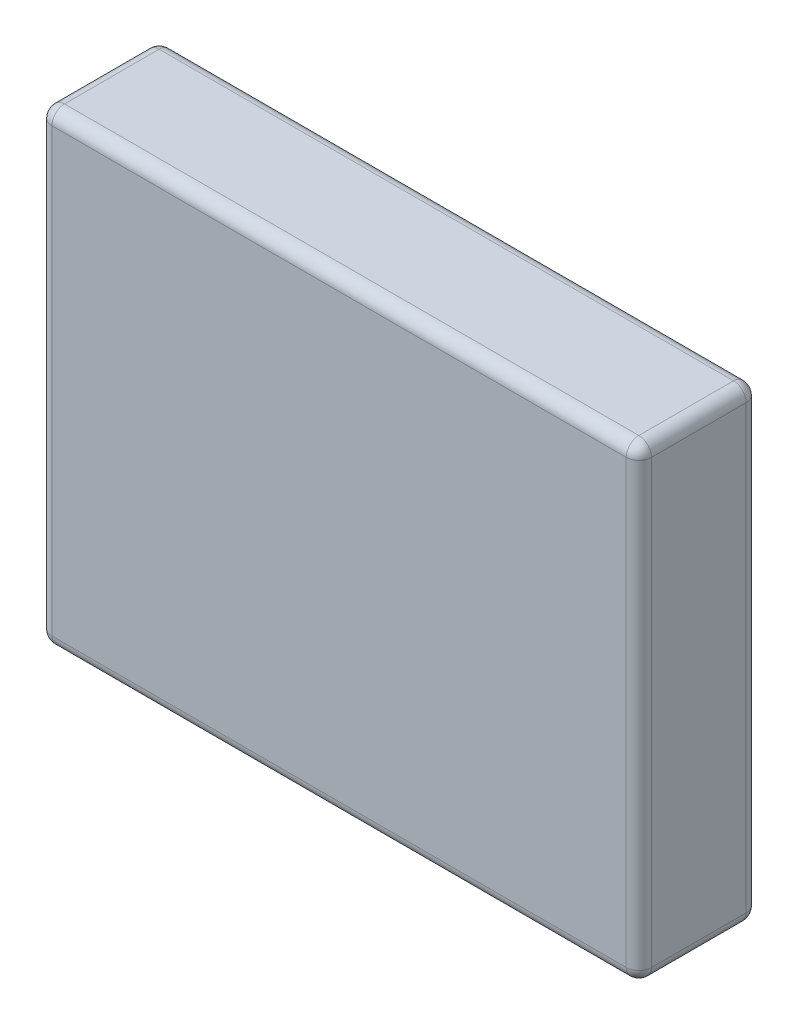
ISO-10303-21;
HEADER;
FILE_DESCRIPTION(('STEP AP214'),'2;1');
FILE_NAME('part.step','',(''),(''),'','','');
FILE_SCHEMA(('AUTOMOTIVE_DESIGN { 1 0 10303 214 1 1 1 1 }'));
ENDSEC;
DATA;
#1=APPLICATION_CONTEXT('core data for automotive mechanical design processes');
#2=APPLICATION_PROTOCOL_DEFINITION('international standard','automotive_design',2000,#1);
#3=PRODUCT_CONTEXT('',#1,'mechanical');
#4=PRODUCT('Part','Part','',(#3));
#5=PRODUCT_RELATED_PRODUCT_CATEGORY('part','',(#4));
#6=PRODUCT_DEFINITION_FORMATION('','',#4);
#7=PRODUCT_DEFINITION_CONTEXT('part definition',#1,'design');
#8=PRODUCT_DEFINITION('design','',#6,#7);
#9=PRODUCT_DEFINITION_SHAPE('','',#8);
#10=(LENGTH_UNIT() NAMED_UNIT(*) SI_UNIT(.MILLI.,.METRE.));
#11=(NAMED_UNIT(*) PLANE_ANGLE_UNIT() SI_UNIT($,.RADIAN.));
#12=(NAMED_UNIT(*) SI_UNIT($,.STERADIAN.) SOLID_ANGLE_UNIT());
#13=UNCERTAINTY_MEASURE_WITH_UNIT(LENGTH_MEASURE(1.E-05),#10,'distance_accuracy_value','');
#14=(GEOMETRIC_REPRESENTATION_CONTEXT(3) GLOBAL_UNCERTAINTY_ASSIGNED_CONTEXT((#13)) GLOBAL_UNIT_ASSIGNED_CONTEXT((#10,
#11,#12)) REPRESENTATION_CONTEXT('',''));
#15=CARTESIAN_POINT('',(0.,0.,0.));
#16=DIRECTION('',(0.,0.,1.));
#17=DIRECTION('',(1.,0.,0.));
#18=AXIS2_PLACEMENT_3D('',#15,#16,#17);
#19=CARTESIAN_POINT('',(-47.5,37.,19.));
#20=DIRECTION('',(1.,0.,0.));
#21=DIRECTION('',(0.,1.,0.));
#22=AXIS2_PLACEMENT_3D('',#19,#20,#21);
#23=PLANE('',#22);
#24=DIRECTION('',(0.,-1.,0.));
#25=VECTOR('',#24,1.);
#26=CARTESIAN_POINT('',(-47.5,37.,17.));
#27=LINE('',#26,#25);
#28=CARTESIAN_POINT('',(-47.5,-35.,17.));
#29=VERTEX_POINT('',#28);
#30=CARTESIAN_POINT('',(-47.5,35.,17.));
#31=VERTEX_POINT('',#30);
#32=EDGE_CURVE('E164',#29,#31,#27,.F.);
#33=ORIENTED_EDGE('',*,*,#32,.T.);
#34=DIRECTION('',(0.,0.,-1.));
#35=VECTOR('',#34,1.);
#36=CARTESIAN_POINT('',(-47.5,35.,19.));
#37=LINE('',#36,#35);
#38=CARTESIAN_POINT('',(-47.5,35.,2.));
#39=VERTEX_POINT('',#38);
#40=EDGE_CURVE('E167',#31,#39,#37,.T.);
#41=ORIENTED_EDGE('',*,*,#40,.T.);
#42=DIRECTION('',(0.,-1.,0.));
#43=VECTOR('',#42,1.);
#44=CARTESIAN_POINT('',(-47.5,37.,2.));
#45=LINE('',#44,#43);
#46=CARTESIAN_POINT('',(-47.5,-35.,2.));
#47=VERTEX_POINT('',#46);
#48=EDGE_CURVE('E138',#39,#47,#45,.T.);
#49=ORIENTED_EDGE('',*,*,#48,.T.);
#50=DIRECTION('',(0.,0.,-1.));
#51=VECTOR('',#50,1.);
#52=CARTESIAN_POINT('',(-47.5,-35.,19.));
#53=LINE('',#52,#51);
#54=EDGE_CURVE('E158',#47,#29,#53,.F.);
#55=ORIENTED_EDGE('',*,*,#54,.T.);
#56=EDGE_LOOP('',(#33,#41,#49,#55));
#57=FACE_BOUND('',#56,.T.);
#58=ADVANCED_FACE('F39',(#57),#23,.F.);
#59=CARTESIAN_POINT('',(-47.5,-37.,19.));
#60=DIRECTION('',(0.,1.,0.));
#61=DIRECTION('',(-1.,0.,0.));
#62=AXIS2_PLACEMENT_3D('',#59,#60,#61);
#63=PLANE('',#62);
#64=DIRECTION('',(1.,0.,0.));
#65=VECTOR('',#64,1.);
#66=CARTESIAN_POINT('',(-47.5,-37.,2.));
#67=LINE('',#66,#65);
#68=CARTESIAN_POINT('',(-45.5,-37.,2.));
#69=VERTEX_POINT('',#68);
#70=CARTESIAN_POINT('',(45.5,-37.,2.));
#71=VERTEX_POINT('',#70);
#72=EDGE_CURVE('E193',#69,#71,#67,.T.);
#73=ORIENTED_EDGE('',*,*,#72,.T.);
#74=DIRECTION('',(0.,0.,-1.));
#75=VECTOR('',#74,1.);
#76=CARTESIAN_POINT('',(45.5,-37.,19.));
#77=LINE('',#76,#75);
#78=CARTESIAN_POINT('',(45.5,-37.,17.));
#79=VERTEX_POINT('',#78);
#80=EDGE_CURVE('E197',#71,#79,#77,.F.);
#81=ORIENTED_EDGE('',*,*,#80,.T.);
#82=DIRECTION('',(1.,0.,0.));
#83=VECTOR('',#82,1.);
#84=CARTESIAN_POINT('',(-47.5,-37.,17.));
#85=LINE('',#84,#83);
#86=CARTESIAN_POINT('',(-45.5,-37.,17.));
#87=VERTEX_POINT('',#86);
#88=EDGE_CURVE('E190',#79,#87,#85,.F.);
#89=ORIENTED_EDGE('',*,*,#88,.T.);
#90=DIRECTION('',(0.,0.,-1.));
#91=VECTOR('',#90,1.);
#92=CARTESIAN_POINT('',(-45.5,-37.,19.));
#93=LINE('',#92,#91);
#94=EDGE_CURVE('E187',#87,#69,#93,.T.);
#95=ORIENTED_EDGE('',*,*,#94,.T.);
#96=EDGE_LOOP('',(#73,#81,#89,#95));
#97=FACE_BOUND('',#96,.T.);
#98=ADVANCED_FACE('F377',(#97),#63,.F.);
#99=CARTESIAN_POINT('',(47.5,37.,19.));
#100=DIRECTION('',(-1.,0.,0.));
#101=DIRECTION('',(0.,-1.,0.));
#102=AXIS2_PLACEMENT_3D('',#99,#100,#101);
#103=PLANE('',#102);
#104=DIRECTION('',(0.,0.,-1.));
#105=VECTOR('',#104,1.);
#106=CARTESIAN_POINT('',(47.5,-35.,19.));
#107=LINE('',#106,#105);
#108=CARTESIAN_POINT('',(47.5,-35.,17.));
#109=VERTEX_POINT('',#108);
#110=CARTESIAN_POINT('',(47.5,-35.,2.));
#111=VERTEX_POINT('',#110);
#112=EDGE_CURVE('E203',#109,#111,#107,.T.);
#113=ORIENTED_EDGE('',*,*,#112,.T.);
#114=DIRECTION('',(0.,1.,0.));
#115=VECTOR('',#114,1.);
#116=CARTESIAN_POINT('',(47.5,37.,2.));
#117=LINE('',#116,#115);
#118=CARTESIAN_POINT('',(47.5,35.,2.));
#119=VERTEX_POINT('',#118);
#120=EDGE_CURVE('E209',#111,#119,#117,.T.);
#121=ORIENTED_EDGE('',*,*,#120,.T.);
#122=DIRECTION('',(0.,0.,-1.));
#123=VECTOR('',#122,1.);
#124=CARTESIAN_POINT('',(47.5,35.,19.));
#125=LINE('',#124,#123);
#126=CARTESIAN_POINT('',(47.5,35.,17.));
#127=VERTEX_POINT('',#126);
#128=EDGE_CURVE('E206',#119,#127,#125,.F.);
#129=ORIENTED_EDGE('',*,*,#128,.T.);
#130=DIRECTION('',(0.,1.,0.));
#131=VECTOR('',#130,1.);
#132=CARTESIAN_POINT('',(47.5,-37.,17.));
#133=LINE('',#132,#131);
#134=EDGE_CURVE('E200',#127,#109,#133,.F.);
#135=ORIENTED_EDGE('',*,*,#134,.T.);
#136=EDGE_LOOP('',(#113,#121,#129,#135));
#137=FACE_BOUND('',#136,.T.);
#138=ADVANCED_FACE('F348',(#137),#103,.F.);
#139=CARTESIAN_POINT('',(-47.5,37.,19.));
#140=DIRECTION('',(0.,-1.,0.));
#141=DIRECTION('',(0.,0.,-1.));
#142=AXIS2_PLACEMENT_3D('',#139,#140,#141);
#143=PLANE('',#142);
#144=DIRECTION('',(-1.,0.,0.));
#145=VECTOR('',#144,1.);
#146=CARTESIAN_POINT('',(-47.5,37.,2.));
#147=LINE('',#146,#145);
#148=CARTESIAN_POINT('',(45.5,37.,2.));
#149=VERTEX_POINT('',#148);
#150=CARTESIAN_POINT('',(-45.5,37.,2.));
#151=VERTEX_POINT('',#150);
#152=EDGE_CURVE('E219',#149,#151,#147,.T.);
#153=ORIENTED_EDGE('',*,*,#152,.T.);
#154=DIRECTION('',(0.,0.,-1.));
#155=VECTOR('',#154,1.);
#156=CARTESIAN_POINT('',(-45.5,37.,19.));
#157=LINE('',#156,#155);
#158=CARTESIAN_POINT('',(-45.5,37.,17.));
#159=VERTEX_POINT('',#158);
#160=EDGE_CURVE('E223',#151,#159,#157,.F.);
#161=ORIENTED_EDGE('',*,*,#160,.T.);
#162=DIRECTION('',(-1.,0.,0.));
#163=VECTOR('',#162,1.);
#164=CARTESIAN_POINT('',(47.5,37.,17.));
#165=LINE('',#164,#163);
#166=CARTESIAN_POINT('',(45.5,37.,17.));
#167=VERTEX_POINT('',#166);
#168=EDGE_CURVE('E216',#159,#167,#165,.F.);
#169=ORIENTED_EDGE('',*,*,#168,.T.);
#170=DIRECTION('',(0.,0.,-1.));
#171=VECTOR('',#170,1.);
#172=CARTESIAN_POINT('',(45.5,37.,19.));
#173=LINE('',#172,#171);
#174=EDGE_CURVE('E213',#167,#149,#173,.T.);
#175=ORIENTED_EDGE('',*,*,#174,.T.);
#176=EDGE_LOOP('',(#153,#161,#169,#175));
#177=FACE_BOUND('',#176,.T.);
#178=ADVANCED_FACE('F323',(#177),#143,.F.);
#179=CARTESIAN_POINT('',(0.,0.,19.));
#180=DIRECTION('',(0.,0.,1.));
#181=DIRECTION('',(1.,0.,0.));
#182=AXIS2_PLACEMENT_3D('',#179,#180,#181);
#183=PLANE('',#182);
#184=DIRECTION('',(-1.,0.,0.));
#185=VECTOR('',#184,1.);
#186=CARTESIAN_POINT('',(-47.5,35.,19.));
#187=LINE('',#186,#185);
#188=CARTESIAN_POINT('',(45.5,35.,19.));
#189=VERTEX_POINT('',#188);
#190=CARTESIAN_POINT('',(-45.5,35.,19.));
#191=VERTEX_POINT('',#190);
#192=EDGE_CURVE('E64',#189,#191,#187,.T.);
#193=ORIENTED_EDGE('',*,*,#192,.T.);
#194=DIRECTION('',(0.,-1.,0.));
#195=VECTOR('',#194,1.);
#196=CARTESIAN_POINT('',(-45.5,-37.,19.));
#197=LINE('',#196,#195);
#198=CARTESIAN_POINT('',(-45.5,-35.,19.));
#199=VERTEX_POINT('',#198);
#200=EDGE_CURVE('E11',#191,#199,#197,.T.);
#201=ORIENTED_EDGE('',*,*,#200,.T.);
#202=DIRECTION('',(1.,0.,0.));
#203=VECTOR('',#202,1.);
#204=CARTESIAN_POINT('',(47.5,-35.,19.));
#205=LINE('',#204,#203);
#206=CARTESIAN_POINT('',(45.5,-35.,19.));
#207=VERTEX_POINT('',#206);
#208=EDGE_CURVE('E49',#199,#207,#205,.T.);
#209=ORIENTED_EDGE('',*,*,#208,.T.);
#210=DIRECTION('',(0.,1.,0.));
#211=VECTOR('',#210,1.);
#212=CARTESIAN_POINT('',(45.5,37.,19.));
#213=LINE('',#212,#211);
#214=EDGE_CURVE('E226',#207,#189,#213,.T.);
#215=ORIENTED_EDGE('',*,*,#214,.T.);
#216=EDGE_LOOP('',(#193,#201,#209,#215));
#217=FACE_BOUND('',#216,.T.);
#218=ADVANCED_FACE('F337',(#217),#183,.T.);
#219=CARTESIAN_POINT('',(0.,0.,0.));
#220=DIRECTION('',(0.,0.,1.));
#221=DIRECTION('',(1.,0.,0.));
#222=AXIS2_PLACEMENT_3D('',#219,#220,#221);
#223=PLANE('',#222);
#224=DIRECTION('',(1.,0.,0.));
#225=VECTOR('',#224,1.);
#226=CARTESIAN_POINT('',(0.,-35.,0.));
#227=LINE('',#226,#225);
#228=CARTESIAN_POINT('',(45.5,-35.,0.));
#229=VERTEX_POINT('',#228);
#230=CARTESIAN_POINT('',(-45.5,-35.,0.));
#231=VERTEX_POINT('',#230);
#232=EDGE_CURVE('E182',#229,#231,#227,.F.);
#233=ORIENTED_EDGE('',*,*,#232,.T.);
#234=DIRECTION('',(0.,-1.,0.));
#235=VECTOR('',#234,1.);
#236=CARTESIAN_POINT('',(-45.5,0.,0.));
#237=LINE('',#236,#235);
#238=CARTESIAN_POINT('',(-45.5,35.,0.));
#239=VERTEX_POINT('',#238);
#240=EDGE_CURVE('E140',#231,#239,#237,.F.);
#241=ORIENTED_EDGE('',*,*,#240,.T.);
#242=DIRECTION('',(-1.,0.,0.));
#243=VECTOR('',#242,1.);
#244=CARTESIAN_POINT('',(0.,35.,0.));
#245=LINE('',#244,#243);
#246=CARTESIAN_POINT('',(45.5,35.,0.));
#247=VERTEX_POINT('',#246);
#248=EDGE_CURVE('E173',#239,#247,#245,.F.);
#249=ORIENTED_EDGE('',*,*,#248,.T.);
#250=DIRECTION('',(0.,1.,0.));
#251=VECTOR('',#250,1.);
#252=CARTESIAN_POINT('',(45.5,0.,0.));
#253=LINE('',#252,#251);
#254=EDGE_CURVE('E179',#247,#229,#253,.F.);
#255=ORIENTED_EDGE('',*,*,#254,.T.);
#256=EDGE_LOOP('',(#233,#241,#249,#255));
#257=FACE_BOUND('',#256,.T.);
#258=ADVANCED_FACE('F535',(#257),#223,.F.);
#259=CARTESIAN_POINT('',(45.5,0.,17.));
#260=DIRECTION('',(0.,-1.,0.));
#261=DIRECTION('',(1.,0.,0.));
#262=AXIS2_PLACEMENT_3D('',#259,#260,#261);
#263=CYLINDRICAL_SURFACE('',#262,2.);
#264=CARTESIAN_POINT('',(45.5,35.,17.));
#265=DIRECTION('',(0.,1.,0.));
#266=DIRECTION('',(0.,0.,1.));
#267=AXIS2_PLACEMENT_3D('',#264,#265,#266);
#268=CIRCLE('',#267,2.);
#269=EDGE_CURVE('E43',#189,#127,#268,.T.);
#270=ORIENTED_EDGE('',*,*,#269,.F.);
#271=ORIENTED_EDGE('',*,*,#214,.F.);
#272=CARTESIAN_POINT('',(45.5,-35.,17.));
#273=DIRECTION('',(0.,-1.,0.));
#274=DIRECTION('',(0.,0.,-1.));
#275=AXIS2_PLACEMENT_3D('',#272,#273,#274);
#276=CIRCLE('',#275,2.);
#277=EDGE_CURVE('E299',#109,#207,#276,.T.);
#278=ORIENTED_EDGE('',*,*,#277,.F.);
#279=ORIENTED_EDGE('',*,*,#134,.F.);
#280=EDGE_LOOP('',(#270,#271,#278,#279));
#281=FACE_BOUND('',#280,.T.);
#282=ADVANCED_FACE('F41',(#281),#263,.T.);
#283=CARTESIAN_POINT('',(45.5,35.,17.));
#284=DIRECTION('',(0.,0.,1.));
#285=DIRECTION('',(1.,0.,0.));
#286=AXIS2_PLACEMENT_3D('',#283,#284,#285);
#287=SPHERICAL_SURFACE('',#286,2.);
#288=CARTESIAN_POINT('',(45.5,35.,17.));
#289=DIRECTION('',(1.,0.,0.));
#290=DIRECTION('',(0.,0.,-1.));
#291=AXIS2_PLACEMENT_3D('',#288,#289,#290);
#292=CIRCLE('',#291,2.);
#293=EDGE_CURVE('E292',#189,#167,#292,.F.);
#294=ORIENTED_EDGE('',*,*,#293,.F.);
#295=ORIENTED_EDGE('',*,*,#269,.T.);
#296=CARTESIAN_POINT('',(45.5,35.,17.));
#297=DIRECTION('',(0.,0.,1.));
#298=DIRECTION('',(1.,0.,0.));
#299=AXIS2_PLACEMENT_3D('',#296,#297,#298);
#300=CIRCLE('',#299,2.);
#301=EDGE_CURVE('E296',#167,#127,#300,.F.);
#302=ORIENTED_EDGE('',*,*,#301,.F.);
#303=EDGE_LOOP('',(#294,#295,#302));
#304=FACE_BOUND('',#303,.T.);
#305=ADVANCED_FACE('F312',(#304),#287,.T.);
#306=CARTESIAN_POINT('',(45.5,-35.,17.));
#307=DIRECTION('',(0.,0.,1.));
#308=DIRECTION('',(1.,0.,0.));
#309=AXIS2_PLACEMENT_3D('',#306,#307,#308);
#310=SPHERICAL_SURFACE('',#309,2.);
#311=CARTESIAN_POINT('',(45.5,-35.,17.));
#312=DIRECTION('',(0.,0.,1.));
#313=DIRECTION('',(1.,0.,0.));
#314=AXIS2_PLACEMENT_3D('',#311,#312,#313);
#315=CIRCLE('',#314,2.);
#316=EDGE_CURVE('E284',#109,#79,#315,.F.);
#317=ORIENTED_EDGE('',*,*,#316,.F.);
#318=ORIENTED_EDGE('',*,*,#277,.T.);
#319=CARTESIAN_POINT('',(45.5,-35.,17.));
#320=DIRECTION('',(1.,0.,0.));
#321=DIRECTION('',(0.,0.,-1.));
#322=AXIS2_PLACEMENT_3D('',#319,#320,#321);
#323=CIRCLE('',#322,2.);
#324=EDGE_CURVE('E288',#79,#207,#323,.F.);
#325=ORIENTED_EDGE('',*,*,#324,.F.);
#326=EDGE_LOOP('',(#317,#318,#325));
#327=FACE_BOUND('',#326,.T.);
#328=ADVANCED_FACE('F340',(#327),#310,.T.);
#329=CARTESIAN_POINT('',(45.5,35.,19.));
#330=DIRECTION('',(0.,0.,-1.));
#331=DIRECTION('',(-1.,0.,0.));
#332=AXIS2_PLACEMENT_3D('',#329,#330,#331);
#333=CYLINDRICAL_SURFACE('',#332,2.);
#334=ORIENTED_EDGE('',*,*,#301,.T.);
#335=ORIENTED_EDGE('',*,*,#128,.F.);
#336=CARTESIAN_POINT('',(45.5,35.,2.));
#337=DIRECTION('',(0.,0.,-1.));
#338=DIRECTION('',(-1.,0.,0.));
#339=AXIS2_PLACEMENT_3D('',#336,#337,#338);
#340=CIRCLE('',#339,2.);
#341=EDGE_CURVE('E277',#149,#119,#340,.T.);
#342=ORIENTED_EDGE('',*,*,#341,.F.);
#343=ORIENTED_EDGE('',*,*,#174,.F.);
#344=EDGE_LOOP('',(#334,#335,#342,#343));
#345=FACE_BOUND('',#344,.T.);
#346=ADVANCED_FACE('F319',(#345),#333,.T.);
#347=CARTESIAN_POINT('',(0.,35.,17.));
#348=DIRECTION('',(1.,0.,0.));
#349=DIRECTION('',(0.,0.,-1.));
#350=AXIS2_PLACEMENT_3D('',#347,#348,#349);
#351=CYLINDRICAL_SURFACE('',#350,2.);
#352=ORIENTED_EDGE('',*,*,#293,.T.);
#353=ORIENTED_EDGE('',*,*,#168,.F.);
#354=CARTESIAN_POINT('',(-45.5,35.,17.));
#355=DIRECTION('',(-1.,0.,0.));
#356=DIRECTION('',(0.,-1.,0.));
#357=AXIS2_PLACEMENT_3D('',#354,#355,#356);
#358=CIRCLE('',#357,2.);
#359=EDGE_CURVE('E273',#191,#159,#358,.T.);
#360=ORIENTED_EDGE('',*,*,#359,.F.);
#361=ORIENTED_EDGE('',*,*,#192,.F.);
#362=EDGE_LOOP('',(#352,#353,#360,#361));
#363=FACE_BOUND('',#362,.T.);
#364=ADVANCED_FACE('F329',(#363),#351,.T.);
#365=CARTESIAN_POINT('',(-45.5,0.,17.));
#366=DIRECTION('',(0.,1.,0.));
#367=DIRECTION('',(-1.,0.,0.));
#368=AXIS2_PLACEMENT_3D('',#365,#366,#367);
#369=CYLINDRICAL_SURFACE('',#368,2.);
#370=CARTESIAN_POINT('',(-45.5,-35.,17.));
#371=DIRECTION('',(0.,-1.,0.));
#372=DIRECTION('',(0.,0.,-1.));
#373=AXIS2_PLACEMENT_3D('',#370,#371,#372);
#374=CIRCLE('',#373,2.);
#375=EDGE_CURVE('E266',#199,#29,#374,.T.);
#376=ORIENTED_EDGE('',*,*,#375,.F.);
#377=ORIENTED_EDGE('',*,*,#200,.F.);
#378=CARTESIAN_POINT('',(-45.5,35.,17.));
#379=DIRECTION('',(0.,1.,0.));
#380=DIRECTION('',(0.,0.,1.));
#381=AXIS2_PLACEMENT_3D('',#378,#379,#380);
#382=CIRCLE('',#381,2.);
#383=EDGE_CURVE('E269',#31,#191,#382,.T.);
#384=ORIENTED_EDGE('',*,*,#383,.F.);
#385=ORIENTED_EDGE('',*,*,#32,.F.);
#386=EDGE_LOOP('',(#376,#377,#384,#385));
#387=FACE_BOUND('',#386,.T.);
#388=ADVANCED_FACE('F335',(#387),#369,.T.);
#389=CARTESIAN_POINT('',(0.,-35.,17.));
#390=DIRECTION('',(-1.,0.,0.));
#391=DIRECTION('',(0.,-1.,0.));
#392=AXIS2_PLACEMENT_3D('',#389,#390,#391);
#393=CYLINDRICAL_SURFACE('',#392,2.);
#394=ORIENTED_EDGE('',*,*,#324,.T.);
#395=ORIENTED_EDGE('',*,*,#208,.F.);
#396=CARTESIAN_POINT('',(-45.5,-35.,17.));
#397=DIRECTION('',(-1.,0.,0.));
#398=DIRECTION('',(0.,0.,1.));
#399=AXIS2_PLACEMENT_3D('',#396,#397,#398);
#400=CIRCLE('',#399,2.);
#401=EDGE_CURVE('E57',#87,#199,#400,.T.);
#402=ORIENTED_EDGE('',*,*,#401,.F.);
#403=ORIENTED_EDGE('',*,*,#88,.F.);
#404=EDGE_LOOP('',(#394,#395,#402,#403));
#405=FACE_BOUND('',#404,.T.);
#406=ADVANCED_FACE('F479',(#405),#393,.T.);
#407=CARTESIAN_POINT('',(45.5,-35.,19.));
#408=DIRECTION('',(0.,0.,-1.));
#409=DIRECTION('',(-1.,0.,0.));
#410=AXIS2_PLACEMENT_3D('',#407,#408,#409);
#411=CYLINDRICAL_SURFACE('',#410,2.);
#412=ORIENTED_EDGE('',*,*,#316,.T.);
#413=ORIENTED_EDGE('',*,*,#80,.F.);
#414=CARTESIAN_POINT('',(45.5,-35.,2.));
#415=DIRECTION('',(0.,0.,-1.));
#416=DIRECTION('',(-1.,0.,0.));
#417=AXIS2_PLACEMENT_3D('',#414,#415,#416);
#418=CIRCLE('',#417,2.);
#419=EDGE_CURVE('E260',#111,#71,#418,.T.);
#420=ORIENTED_EDGE('',*,*,#419,.F.);
#421=ORIENTED_EDGE('',*,*,#112,.F.);
#422=EDGE_LOOP('',(#412,#413,#420,#421));
#423=FACE_BOUND('',#422,.T.);
#424=ADVANCED_FACE('F345',(#423),#411,.T.);
#425=CARTESIAN_POINT('',(45.5,37.,2.));
#426=DIRECTION('',(0.,1.,0.));
#427=DIRECTION('',(-1.,0.,0.));
#428=AXIS2_PLACEMENT_3D('',#425,#426,#427);
#429=CYLINDRICAL_SURFACE('',#428,2.);
#430=CARTESIAN_POINT('',(45.5,35.,2.));
#431=DIRECTION('',(0.,1.,0.));
#432=DIRECTION('',(0.,0.,1.));
#433=AXIS2_PLACEMENT_3D('',#430,#431,#432);
#434=CIRCLE('',#433,2.);
#435=EDGE_CURVE('E280',#119,#247,#434,.T.);
#436=ORIENTED_EDGE('',*,*,#435,.F.);
#437=ORIENTED_EDGE('',*,*,#120,.F.);
#438=CARTESIAN_POINT('',(45.5,-35.,2.));
#439=DIRECTION('',(0.,-1.,0.));
#440=DIRECTION('',(1.,0.,0.));
#441=AXIS2_PLACEMENT_3D('',#438,#439,#440);
#442=CIRCLE('',#441,2.);
#443=EDGE_CURVE('E256',#229,#111,#442,.T.);
#444=ORIENTED_EDGE('',*,*,#443,.F.);
#445=ORIENTED_EDGE('',*,*,#254,.F.);
#446=EDGE_LOOP('',(#436,#437,#444,#445));
#447=FACE_BOUND('',#446,.T.);
#448=ADVANCED_FACE('F352',(#447),#429,.T.);
#449=CARTESIAN_POINT('',(45.5,35.,2.));
#450=DIRECTION('',(0.,0.,1.));
#451=DIRECTION('',(1.,0.,0.));
#452=AXIS2_PLACEMENT_3D('',#449,#450,#451);
#453=SPHERICAL_SURFACE('',#452,2.);
#454=ORIENTED_EDGE('',*,*,#341,.T.);
#455=ORIENTED_EDGE('',*,*,#435,.T.);
#456=CARTESIAN_POINT('',(45.5,35.,2.));
#457=DIRECTION('',(1.,0.,0.));
#458=DIRECTION('',(0.,0.,-1.));
#459=AXIS2_PLACEMENT_3D('',#456,#457,#458);
#460=CIRCLE('',#459,2.);
#461=EDGE_CURVE('E252',#149,#247,#460,.F.);
#462=ORIENTED_EDGE('',*,*,#461,.F.);
#463=EDGE_LOOP('',(#454,#455,#462));
#464=FACE_BOUND('',#463,.T.);
#465=ADVANCED_FACE('F356',(#464),#453,.T.);
#466=CARTESIAN_POINT('',(-45.5,35.,17.));
#467=DIRECTION('',(0.,0.,1.));
#468=DIRECTION('',(1.,0.,0.));
#469=AXIS2_PLACEMENT_3D('',#466,#467,#468);
#470=SPHERICAL_SURFACE('',#469,2.);
#471=ORIENTED_EDGE('',*,*,#383,.T.);
#472=ORIENTED_EDGE('',*,*,#359,.T.);
#473=CARTESIAN_POINT('',(-45.5,35.,17.));
#474=DIRECTION('',(0.,0.,1.));
#475=DIRECTION('',(1.,0.,0.));
#476=AXIS2_PLACEMENT_3D('',#473,#474,#475);
#477=CIRCLE('',#476,2.);
#478=EDGE_CURVE('E248',#31,#159,#477,.F.);
#479=ORIENTED_EDGE('',*,*,#478,.F.);
#480=EDGE_LOOP('',(#471,#472,#479));
#481=FACE_BOUND('',#480,.T.);
#482=ADVANCED_FACE('F333',(#481),#470,.T.);
#483=CARTESIAN_POINT('',(-45.5,-35.,17.));
#484=DIRECTION('',(0.,0.,1.));
#485=DIRECTION('',(1.,0.,0.));
#486=AXIS2_PLACEMENT_3D('',#483,#484,#485);
#487=SPHERICAL_SURFACE('',#486,2.);
#488=ORIENTED_EDGE('',*,*,#401,.T.);
#489=ORIENTED_EDGE('',*,*,#375,.T.);
#490=CARTESIAN_POINT('',(-45.5,-35.,17.));
#491=DIRECTION('',(0.,0.,1.));
#492=DIRECTION('',(1.,0.,0.));
#493=AXIS2_PLACEMENT_3D('',#490,#491,#492);
#494=CIRCLE('',#493,2.);
#495=EDGE_CURVE('E160',#87,#29,#494,.F.);
#496=ORIENTED_EDGE('',*,*,#495,.F.);
#497=EDGE_LOOP('',(#488,#489,#496));
#498=FACE_BOUND('',#497,.T.);
#499=ADVANCED_FACE('F437',(#498),#487,.T.);
#500=CARTESIAN_POINT('',(45.5,-35.,2.));
#501=DIRECTION('',(0.,0.,1.));
#502=DIRECTION('',(1.,0.,0.));
#503=AXIS2_PLACEMENT_3D('',#500,#501,#502);
#504=SPHERICAL_SURFACE('',#503,2.);
#505=ORIENTED_EDGE('',*,*,#443,.T.);
#506=ORIENTED_EDGE('',*,*,#419,.T.);
#507=CARTESIAN_POINT('',(45.5,-35.,2.));
#508=DIRECTION('',(1.,0.,0.));
#509=DIRECTION('',(0.,0.,-1.));
#510=AXIS2_PLACEMENT_3D('',#507,#508,#509);
#511=CIRCLE('',#510,2.);
#512=EDGE_CURVE('E243',#229,#71,#511,.F.);
#513=ORIENTED_EDGE('',*,*,#512,.F.);
#514=EDGE_LOOP('',(#505,#506,#513));
#515=FACE_BOUND('',#514,.T.);
#516=ADVANCED_FACE('F428',(#515),#504,.T.);
#517=CARTESIAN_POINT('',(-47.5,35.,2.));
#518=DIRECTION('',(-1.,0.,0.));
#519=DIRECTION('',(0.,0.,1.));
#520=AXIS2_PLACEMENT_3D('',#517,#518,#519);
#521=CYLINDRICAL_SURFACE('',#520,2.);
#522=ORIENTED_EDGE('',*,*,#461,.T.);
#523=ORIENTED_EDGE('',*,*,#248,.F.);
#524=CARTESIAN_POINT('',(-45.5,35.,2.));
#525=DIRECTION('',(-1.,0.,0.));
#526=DIRECTION('',(0.,0.,1.));
#527=AXIS2_PLACEMENT_3D('',#524,#525,#526);
#528=CIRCLE('',#527,2.);
#529=EDGE_CURVE('E239',#151,#239,#528,.T.);
#530=ORIENTED_EDGE('',*,*,#529,.F.);
#531=ORIENTED_EDGE('',*,*,#152,.F.);
#532=EDGE_LOOP('',(#522,#523,#530,#531));
#533=FACE_BOUND('',#532,.T.);
#534=ADVANCED_FACE('F359',(#533),#521,.T.);
#535=CARTESIAN_POINT('',(-45.5,35.,19.));
#536=DIRECTION('',(0.,0.,-1.));
#537=DIRECTION('',(-1.,0.,0.));
#538=AXIS2_PLACEMENT_3D('',#535,#536,#537);
#539=CYLINDRICAL_SURFACE('',#538,2.);
#540=ORIENTED_EDGE('',*,*,#478,.T.);
#541=ORIENTED_EDGE('',*,*,#160,.F.);
#542=CARTESIAN_POINT('',(-45.5,35.,2.));
#543=DIRECTION('',(0.,0.,-1.));
#544=DIRECTION('',(-1.,0.,0.));
#545=AXIS2_PLACEMENT_3D('',#542,#543,#544);
#546=CIRCLE('',#545,2.);
#547=EDGE_CURVE('E155',#39,#151,#546,.T.);
#548=ORIENTED_EDGE('',*,*,#547,.F.);
#549=ORIENTED_EDGE('',*,*,#40,.F.);
#550=EDGE_LOOP('',(#540,#541,#548,#549));
#551=FACE_BOUND('',#550,.T.);
#552=ADVANCED_FACE('F364',(#551),#539,.T.);
#553=CARTESIAN_POINT('',(-45.5,-35.,19.));
#554=DIRECTION('',(0.,0.,-1.));
#555=DIRECTION('',(-1.,0.,0.));
#556=AXIS2_PLACEMENT_3D('',#553,#554,#555);
#557=CYLINDRICAL_SURFACE('',#556,2.);
#558=ORIENTED_EDGE('',*,*,#495,.T.);
#559=ORIENTED_EDGE('',*,*,#54,.F.);
#560=CARTESIAN_POINT('',(-45.5,-35.,2.));
#561=DIRECTION('',(0.,0.,-1.));
#562=DIRECTION('',(-1.,0.,0.));
#563=AXIS2_PLACEMENT_3D('',#560,#561,#562);
#564=CIRCLE('',#563,2.);
#565=EDGE_CURVE('E147',#69,#47,#564,.T.);
#566=ORIENTED_EDGE('',*,*,#565,.F.);
#567=ORIENTED_EDGE('',*,*,#94,.F.);
#568=EDGE_LOOP('',(#558,#559,#566,#567));
#569=FACE_BOUND('',#568,.T.);
#570=ADVANCED_FACE('F159',(#569),#557,.T.);
#571=CARTESIAN_POINT('',(-47.5,-35.,2.));
#572=DIRECTION('',(1.,0.,0.));
#573=DIRECTION('',(0.,1.,0.));
#574=AXIS2_PLACEMENT_3D('',#571,#572,#573);
#575=CYLINDRICAL_SURFACE('',#574,2.);
#576=ORIENTED_EDGE('',*,*,#512,.T.);
#577=ORIENTED_EDGE('',*,*,#72,.F.);
#578=CARTESIAN_POINT('',(-45.5,-35.,2.));
#579=DIRECTION('',(-1.,0.,0.));
#580=DIRECTION('',(0.,0.,1.));
#581=AXIS2_PLACEMENT_3D('',#578,#579,#580);
#582=CIRCLE('',#581,2.);
#583=EDGE_CURVE('E151',#231,#69,#582,.T.);
#584=ORIENTED_EDGE('',*,*,#583,.F.);
#585=ORIENTED_EDGE('',*,*,#232,.F.);
#586=EDGE_LOOP('',(#576,#577,#584,#585));
#587=FACE_BOUND('',#586,.T.);
#588=ADVANCED_FACE('F367',(#587),#575,.T.);
#589=CARTESIAN_POINT('',(-45.5,35.,2.));
#590=DIRECTION('',(0.,0.,1.));
#591=DIRECTION('',(1.,0.,0.));
#592=AXIS2_PLACEMENT_3D('',#589,#590,#591);
#593=SPHERICAL_SURFACE('',#592,2.);
#594=ORIENTED_EDGE('',*,*,#547,.T.);
#595=ORIENTED_EDGE('',*,*,#529,.T.);
#596=CARTESIAN_POINT('',(-45.5,35.,2.));
#597=DIRECTION('',(0.,1.,0.));
#598=DIRECTION('',(0.,0.,1.));
#599=AXIS2_PLACEMENT_3D('',#596,#597,#598);
#600=CIRCLE('',#599,2.);
#601=EDGE_CURVE('E144',#39,#239,#600,.F.);
#602=ORIENTED_EDGE('',*,*,#601,.F.);
#603=EDGE_LOOP('',(#594,#595,#602));
#604=FACE_BOUND('',#603,.T.);
#605=ADVANCED_FACE('F365',(#604),#593,.T.);
#606=CARTESIAN_POINT('',(-45.5,-35.,2.));
#607=DIRECTION('',(0.,0.,1.));
#608=DIRECTION('',(1.,0.,0.));
#609=AXIS2_PLACEMENT_3D('',#606,#607,#608);
#610=SPHERICAL_SURFACE('',#609,2.);
#611=ORIENTED_EDGE('',*,*,#583,.T.);
#612=ORIENTED_EDGE('',*,*,#565,.T.);
#613=CARTESIAN_POINT('',(-45.5,-35.,2.));
#614=DIRECTION('',(0.,-1.,0.));
#615=DIRECTION('',(0.,0.,-1.));
#616=AXIS2_PLACEMENT_3D('',#613,#614,#615);
#617=CIRCLE('',#616,2.);
#618=EDGE_CURVE('E134',#231,#47,#617,.F.);
#619=ORIENTED_EDGE('',*,*,#618,.F.);
#620=EDGE_LOOP('',(#611,#612,#619));
#621=FACE_BOUND('',#620,.T.);
#622=ADVANCED_FACE('F149',(#621),#610,.T.);
#623=CARTESIAN_POINT('',(-45.5,37.,2.));
#624=DIRECTION('',(0.,-1.,0.));
#625=DIRECTION('',(1.,0.,0.));
#626=AXIS2_PLACEMENT_3D('',#623,#624,#625);
#627=CYLINDRICAL_SURFACE('',#626,2.);
#628=ORIENTED_EDGE('',*,*,#601,.T.);
#629=ORIENTED_EDGE('',*,*,#240,.F.);
#630=ORIENTED_EDGE('',*,*,#618,.T.);
#631=ORIENTED_EDGE('',*,*,#48,.F.);
#632=EDGE_LOOP('',(#628,#629,#630,#631));
#633=FACE_BOUND('',#632,.T.);
#634=ADVANCED_FACE('F136',(#633),#627,.T.);
#635=CLOSED_SHELL('',(#58,#98,#138,#178,#218,#258,#282,#305,#328,#346,#364,#388,#406,#424,#448,
#465,#482,#499,#516,#534,#552,#570,#588,#605,#622,#634));
#636=MANIFOLD_SOLID_BREP('B2',#635);
#637=ADVANCED_BREP_SHAPE_REPRESENTATION('',(#18,#636),#14);
#638=SHAPE_DEFINITION_REPRESENTATION(#9,#637);
ENDSEC;
END-ISO-10303-21;
